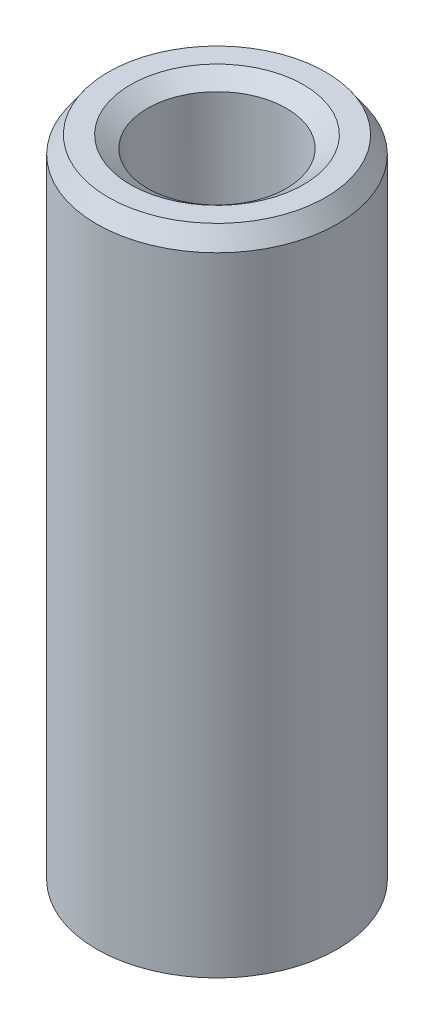
ISO-10303-21;
HEADER;
FILE_DESCRIPTION(('STEP AP214'),'2;1');
FILE_NAME('part.step','',(''),(''),'','','');
FILE_SCHEMA(('AUTOMOTIVE_DESIGN { 1 0 10303 214 1 1 1 1 }'));
ENDSEC;
DATA;
#1=APPLICATION_CONTEXT('core data for automotive mechanical design processes');
#2=APPLICATION_PROTOCOL_DEFINITION('international standard','automotive_design',2000,#1);
#3=PRODUCT_CONTEXT('',#1,'mechanical');
#4=PRODUCT('Part','Part','',(#3));
#5=PRODUCT_RELATED_PRODUCT_CATEGORY('part','',(#4));
#6=PRODUCT_DEFINITION_FORMATION('','',#4);
#7=PRODUCT_DEFINITION_CONTEXT('part definition',#1,'design');
#8=PRODUCT_DEFINITION('design','',#6,#7);
#9=PRODUCT_DEFINITION_SHAPE('','',#8);
#10=(LENGTH_UNIT() NAMED_UNIT(*) SI_UNIT(.MILLI.,.METRE.));
#11=(NAMED_UNIT(*) PLANE_ANGLE_UNIT() SI_UNIT($,.RADIAN.));
#12=(NAMED_UNIT(*) SI_UNIT($,.STERADIAN.) SOLID_ANGLE_UNIT());
#13=UNCERTAINTY_MEASURE_WITH_UNIT(LENGTH_MEASURE(1.E-05),#10,'distance_accuracy_value','');
#14=(GEOMETRIC_REPRESENTATION_CONTEXT(3) GLOBAL_UNCERTAINTY_ASSIGNED_CONTEXT((#13)) GLOBAL_UNIT_ASSIGNED_CONTEXT((#10,
#11,#12)) REPRESENTATION_CONTEXT('',''));
#15=CARTESIAN_POINT('',(0.,0.,0.));
#16=DIRECTION('',(0.,0.,1.));
#17=DIRECTION('',(1.,0.,0.));
#18=AXIS2_PLACEMENT_3D('',#15,#16,#17);
#19=CARTESIAN_POINT('',(0.,122.712555154671,0.));
#20=DIRECTION('',(0.,-1.,0.));
#21=DIRECTION('',(0.,0.,-1.));
#22=AXIS2_PLACEMENT_3D('',#19,#20,#21);
#23=CYLINDRICAL_SURFACE('',#22,22.5);
#24=CARTESIAN_POINT('',(0.,2.20859151503121,0.));
#25=DIRECTION('',(0.,1.,0.));
#26=DIRECTION('',(0.,0.,1.));
#27=AXIS2_PLACEMENT_3D('',#24,#25,#26);
#28=CIRCLE('',#27,22.5);
#29=CARTESIAN_POINT('',(0.,2.20859151503121,22.5));
#30=VERTEX_POINT('',#29);
#31=EDGE_CURVE('E10',#30,#30,#28,.T.);
#32=ORIENTED_EDGE('',*,*,#31,.T.);
#33=EDGE_LOOP('',(#32));
#34=FACE_BOUND('',#33,.T.);
#35=CARTESIAN_POINT('',(0.,119.515010099549,0.));
#36=DIRECTION('',(0.,1.,0.));
#37=DIRECTION('',(0.,0.,1.));
#38=AXIS2_PLACEMENT_3D('',#35,#36,#37);
#39=CIRCLE('',#38,22.5);
#40=CARTESIAN_POINT('',(0.,119.515010099549,22.5));
#41=VERTEX_POINT('',#40);
#42=EDGE_CURVE('E50',#41,#41,#39,.F.);
#43=ORIENTED_EDGE('',*,*,#42,.T.);
#44=EDGE_LOOP('',(#43));
#45=FACE_BOUND('',#44,.T.);
#46=ADVANCED_FACE('F39',(#34,#45),#23,.T.);
#47=CARTESIAN_POINT('',(0.,122.712555154671,0.));
#48=DIRECTION('',(0.,1.,0.));
#49=DIRECTION('',(0.,0.,1.));
#50=AXIS2_PLACEMENT_3D('',#47,#48,#49);
#51=PLANE('',#50);
#52=CARTESIAN_POINT('',(0.,122.712555154671,0.));
#53=DIRECTION('',(0.,1.,0.));
#54=DIRECTION('',(0.,0.,1.));
#55=AXIS2_PLACEMENT_3D('',#52,#53,#54);
#56=CIRCLE('',#55,16.1676856209604);
#57=CARTESIAN_POINT('',(0.,122.712555154671,16.1676856209604));
#58=VERTEX_POINT('',#57);
#59=EDGE_CURVE('E58',#58,#58,#56,.F.);
#60=ORIENTED_EDGE('',*,*,#59,.T.);
#61=EDGE_LOOP('',(#60));
#62=FACE_BOUND('',#61,.T.);
#63=CARTESIAN_POINT('',(0.,122.712555154671,0.));
#64=DIRECTION('',(0.,1.,0.));
#65=DIRECTION('',(0.,0.,1.));
#66=AXIS2_PLACEMENT_3D('',#63,#64,#65);
#67=CIRCLE('',#66,20.2914084849688);
#68=CARTESIAN_POINT('',(0.,122.712555154671,20.2914084849688));
#69=VERTEX_POINT('',#68);
#70=EDGE_CURVE('E61',#69,#69,#67,.T.);
#71=ORIENTED_EDGE('',*,*,#70,.T.);
#72=EDGE_LOOP('',(#71));
#73=FACE_BOUND('',#72,.T.);
#74=ADVANCED_FACE('F88',(#62,#73),#51,.T.);
#75=CARTESIAN_POINT('',(0.,0.,0.));
#76=DIRECTION('',(0.,1.,0.));
#77=DIRECTION('',(0.,0.,1.));
#78=AXIS2_PLACEMENT_3D('',#75,#76,#77);
#79=PLANE('',#78);
#80=CARTESIAN_POINT('',(0.,0.,0.));
#81=DIRECTION('',(0.,1.,0.));
#82=DIRECTION('',(0.,0.,1.));
#83=AXIS2_PLACEMENT_3D('',#80,#81,#82);
#84=CIRCLE('',#83,15.17873208087);
#85=CARTESIAN_POINT('',(0.,0.,-15.17873208087));
#86=VERTEX_POINT('',#85);
#87=EDGE_CURVE('E51',#86,#86,#84,.T.);
#88=ORIENTED_EDGE('',*,*,#87,.T.);
#89=EDGE_LOOP('',(#88));
#90=FACE_BOUND('',#89,.T.);
#91=CARTESIAN_POINT('',(0.,0.,0.));
#92=DIRECTION('',(0.,1.,0.));
#93=DIRECTION('',(0.,0.,1.));
#94=AXIS2_PLACEMENT_3D('',#91,#92,#93);
#95=CIRCLE('',#94,19.3024549448785);
#96=CARTESIAN_POINT('',(0.,0.,19.3024549448785));
#97=VERTEX_POINT('',#96);
#98=EDGE_CURVE('E54',#97,#97,#95,.F.);
#99=ORIENTED_EDGE('',*,*,#98,.T.);
#100=EDGE_LOOP('',(#99));
#101=FACE_BOUND('',#100,.T.);
#102=ADVANCED_FACE('F83',(#90,#101),#79,.F.);
#103=CARTESIAN_POINT('',(0.,122.712555154671,0.));
#104=DIRECTION('',(0.,-1.,0.));
#105=DIRECTION('',(0.,0.,-1.));
#106=AXIS2_PLACEMENT_3D('',#103,#104,#105);
#107=CYLINDRICAL_SURFACE('',#106,12.9701405658388);
#108=CARTESIAN_POINT('',(0.,120.50396363964,0.));
#109=DIRECTION('',(0.,1.,0.));
#110=DIRECTION('',(0.,0.,1.));
#111=AXIS2_PLACEMENT_3D('',#108,#109,#110);
#112=CIRCLE('',#111,12.9701405658388);
#113=CARTESIAN_POINT('',(0.,120.50396363964,12.9701405658388));
#114=VERTEX_POINT('',#113);
#115=EDGE_CURVE('E67',#114,#114,#112,.T.);
#116=ORIENTED_EDGE('',*,*,#115,.T.);
#117=EDGE_LOOP('',(#116));
#118=FACE_BOUND('',#117,.T.);
#119=CARTESIAN_POINT('',(0.,3.19754505512151,0.));
#120=DIRECTION('',(0.,1.,0.));
#121=DIRECTION('',(0.,0.,1.));
#122=AXIS2_PLACEMENT_3D('',#119,#120,#121);
#123=CIRCLE('',#122,12.9701405658388);
#124=CARTESIAN_POINT('',(0.,3.19754505512151,-12.9701405658388));
#125=VERTEX_POINT('',#124);
#126=EDGE_CURVE('E69',#125,#125,#123,.F.);
#127=ORIENTED_EDGE('',*,*,#126,.T.);
#128=EDGE_LOOP('',(#127));
#129=FACE_BOUND('',#128,.T.);
#130=ADVANCED_FACE('F71',(#118,#129),#107,.F.);
#131=CARTESIAN_POINT('',(0.,120.50396363964,0.));
#132=DIRECTION('',(0.,1.,0.));
#133=DIRECTION('',(0.,0.,1.));
#134=AXIS2_PLACEMENT_3D('',#131,#132,#133);
#135=CONICAL_SURFACE('',#134,12.9701405658388,0.966329299025611);
#136=ORIENTED_EDGE('',*,*,#59,.F.);
#137=EDGE_LOOP('',(#136));
#138=FACE_BOUND('',#137,.T.);
#139=ORIENTED_EDGE('',*,*,#115,.F.);
#140=EDGE_LOOP('',(#139));
#141=FACE_BOUND('',#140,.T.);
#142=ADVANCED_FACE('F77',(#138,#141),#135,.F.);
#143=CARTESIAN_POINT('',(0.,0.,0.));
#144=DIRECTION('',(0.,-1.,0.));
#145=DIRECTION('',(0.,0.,-1.));
#146=AXIS2_PLACEMENT_3D('',#143,#144,#145);
#147=CONICAL_SURFACE('',#146,15.17873208087,0.604467027769286);
#148=CARTESIAN_POINT('',(0.,3.19754505512151,-12.9701405658388));
#149=CARTESIAN_POINT('',(0.,3.16423729413066,-12.9931467274537));
#150=CARTESIAN_POINT('',(0.,3.13092953313982,-13.0161528890687));
#151=CARTESIAN_POINT('',(0.,3.06431401115812,-13.0621652122985));
#152=CARTESIAN_POINT('',(0.,3.03100625016727,-13.0851713739134));
#153=CARTESIAN_POINT('',(0.,2.96439072818557,-13.1311836971432));
#154=CARTESIAN_POINT('',(0.,2.93108296719472,-13.1541898587581));
#155=CARTESIAN_POINT('',(0.,2.86446744521302,-13.2002021819879));
#156=CARTESIAN_POINT('',(0.,2.83115968422217,-13.2232083436028));
#157=CARTESIAN_POINT('',(0.,2.76454416224048,-13.2692206668327));
#158=CARTESIAN_POINT('',(0.,2.73123640124963,-13.2922268284476));
#159=CARTESIAN_POINT('',(0.,2.66462087926793,-13.3382391516774));
#160=CARTESIAN_POINT('',(0.,2.63131311827708,-13.3612453132923));
#161=CARTESIAN_POINT('',(0.,2.56469759629538,-13.4072576365221));
#162=CARTESIAN_POINT('',(0.,2.53138983530453,-13.430263798137));
#163=CARTESIAN_POINT('',(0.,2.46477431332283,-13.4762761213668));
#164=CARTESIAN_POINT('',(0.,2.43146655233198,-13.4992822829817));
#165=CARTESIAN_POINT('',(0.,2.36485103035029,-13.5452946062116));
#166=CARTESIAN_POINT('',(0.,2.33154326935944,-13.5683007678265));
#167=CARTESIAN_POINT('',(0.,2.26492774737774,-13.6143130910563));
#168=CARTESIAN_POINT('',(0.,2.23161998638689,-13.6373192526712));
#169=CARTESIAN_POINT('',(0.,2.16500446440519,-13.683331575901));
#170=CARTESIAN_POINT('',(0.,2.13169670341434,-13.7063377375159));
#171=CARTESIAN_POINT('',(0.,2.06508118143264,-13.7523500607457));
#172=CARTESIAN_POINT('',(0.,2.0317734204418,-13.7753562223606));
#173=CARTESIAN_POINT('',(0.,1.9651578984601,-13.8213685455905));
#174=CARTESIAN_POINT('',(0.,1.93185013746925,-13.8443747072054));
#175=CARTESIAN_POINT('',(0.,1.86523461548755,-13.8903870304352));
#176=CARTESIAN_POINT('',(0.,1.8319268544967,-13.9133931920501));
#177=CARTESIAN_POINT('',(0.,1.765311332515,-13.9594055152799));
#178=CARTESIAN_POINT('',(0.,1.73200357152415,-13.9824116768948));
#179=CARTESIAN_POINT('',(0.,1.66538804954246,-14.0284240001246));
#180=CARTESIAN_POINT('',(0.,1.63208028855161,-14.0514301617395));
#181=CARTESIAN_POINT('',(0.,1.56546476656991,-14.0974424849694));
#182=CARTESIAN_POINT('',(0.,1.53215700557906,-14.1204486465843));
#183=CARTESIAN_POINT('',(0.,1.46554148359736,-14.1664609698141));
#184=CARTESIAN_POINT('',(0.,1.43223372260651,-14.189467131429));
#185=CARTESIAN_POINT('',(0.,1.36561820062481,-14.2354794546588));
#186=CARTESIAN_POINT('',(0.,1.33231043963396,-14.2584856162737));
#187=CARTESIAN_POINT('',(0.,1.26569491765227,-14.3044979395035));
#188=CARTESIAN_POINT('',(0.,1.23238715666142,-14.3275041011184));
#189=CARTESIAN_POINT('',(0.,1.16577163467972,-14.3735164243483));
#190=CARTESIAN_POINT('',(0.,1.13246387368887,-14.3965225859632));
#191=CARTESIAN_POINT('',(0.,1.06584835170717,-14.442534909193));
#192=CARTESIAN_POINT('',(0.,1.03254059071632,-14.4655410708079));
#193=CARTESIAN_POINT('',(0.,0.965925068734624,-14.5115533940377));
#194=CARTESIAN_POINT('',(0.,0.932617307743775,-14.5345595556526));
#195=CARTESIAN_POINT('',(0.,0.866001785762077,-14.5805718788824));
#196=CARTESIAN_POINT('',(0.,0.832694024771228,-14.6035780404973));
#197=CARTESIAN_POINT('',(0.,0.766078502789529,-14.6495903637272));
#198=CARTESIAN_POINT('',(0.,0.73277074179868,-14.6725965253421));
#199=CARTESIAN_POINT('',(0.,0.666155219816982,-14.7186088485719));
#200=CARTESIAN_POINT('',(0.,0.632847458826133,-14.7416150101868));
#201=CARTESIAN_POINT('',(0.,0.566231936844435,-14.7876273334166));
#202=CARTESIAN_POINT('',(0.,0.532924175853586,-14.8106334950315));
#203=CARTESIAN_POINT('',(0.,0.466308653871888,-14.8566458182613));
#204=CARTESIAN_POINT('',(0.,0.433000892881038,-14.8796519798762));
#205=CARTESIAN_POINT('',(0.,0.36638537089934,-14.9256643031061));
#206=CARTESIAN_POINT('',(0.,0.333077609908491,-14.948670464721));
#207=CARTESIAN_POINT('',(0.,0.266462087926793,-14.9946827879508));
#208=CARTESIAN_POINT('',(0.,0.233154326935944,-15.0176889495657));
#209=CARTESIAN_POINT('',(0.,0.166538804954246,-15.0637012727955));
#210=CARTESIAN_POINT('',(0.,0.133231043963396,-15.0867074344104));
#211=CARTESIAN_POINT('',(0.,0.0666155219816979,-15.1327197576402));
#212=CARTESIAN_POINT('',(0.,0.0333077609908487,-15.1557259192551));
#213=CARTESIAN_POINT('',(0.,0.,-15.17873208087));
#214=B_SPLINE_CURVE_WITH_KNOTS('',3,(#148,#149,#150,#151,#152,#153,#154,#155,#156,#157,#158,
#159,#160,#161,#162,#163,#164,#165,#166,#167,#168,#169,#170,#171,#172,#173,#174,#175,#176,#177,
#178,#179,#180,#181,#182,#183,#184,#185,#186,#187,#188,#189,#190,#191,#192,#193,#194,#195,#196,
#197,#198,#199,#200,#201,#202,#203,#204,#205,#206,#207,#208,#209,#210,#211,#212,#213),
.UNSPECIFIED.,.F.,.F.,(4,2,2,2,2,2,2,2,2,2,2,2,2,2,2,2,2,2,2,2,2,2,2,2,2,2,2,2,2,2,2,2,4),(0.,
0.121442223836166,0.242884447672332,0.364326671508496,0.485768895344662,0.607211119180828,
0.728653343016993,0.850095566853159,0.971537790689324,1.09298001452549,1.21442223836165,
1.33586446219782,1.45730668603399,1.57874890987015,1.70019113370632,1.82163335754248,
1.94307558137865,2.06451780521481,2.18596002905098,2.30740225288714,2.42884447672331,
2.55028670055947,2.67172892439564,2.79317114823181,2.91461337206797,3.03605559590414,
3.1574978197403,3.27894004357647,3.40038226741263,3.5218244912488,3.64326671508497,
3.76470893892113,3.8861511627573),.UNSPECIFIED.);
#215=EDGE_CURVE('BSEAM73',#125,#86,#214,.T.);
#216=ORIENTED_EDGE('',*,*,#126,.F.);
#217=ORIENTED_EDGE('',*,*,#87,.F.);
#218=ORIENTED_EDGE('',*,*,#215,.T.);
#219=ORIENTED_EDGE('',*,*,#215,.F.);
#220=EDGE_LOOP('',(#216,#218,#217,#219));
#221=FACE_BOUND('',#220,.T.);
#222=ADVANCED_FACE('F73',(#221),#147,.F.);
#223=CARTESIAN_POINT('',(0.,2.20859151503121,0.));
#224=DIRECTION('',(0.,1.,0.));
#225=DIRECTION('',(0.,0.,1.));
#226=AXIS2_PLACEMENT_3D('',#223,#224,#225);
#227=CONICAL_SURFACE('',#226,22.5,0.966329299025614);
#228=ORIENTED_EDGE('',*,*,#98,.F.);
#229=EDGE_LOOP('',(#228));
#230=FACE_BOUND('',#229,.T.);
#231=ORIENTED_EDGE('',*,*,#31,.F.);
#232=EDGE_LOOP('',(#231));
#233=FACE_BOUND('',#232,.T.);
#234=ADVANCED_FACE('F76',(#230,#233),#227,.T.);
#235=CARTESIAN_POINT('',(0.,122.712555154671,0.));
#236=DIRECTION('',(0.,-1.,0.));
#237=DIRECTION('',(0.,0.,-1.));
#238=AXIS2_PLACEMENT_3D('',#235,#236,#237);
#239=CONICAL_SURFACE('',#238,20.2914084849688,0.604467027769283);
#240=ORIENTED_EDGE('',*,*,#42,.F.);
#241=EDGE_LOOP('',(#240));
#242=FACE_BOUND('',#241,.T.);
#243=ORIENTED_EDGE('',*,*,#70,.F.);
#244=EDGE_LOOP('',(#243));
#245=FACE_BOUND('',#244,.T.);
#246=ADVANCED_FACE('F45',(#242,#245),#239,.T.);
#247=CLOSED_SHELL('',(#46,#74,#102,#130,#142,#222,#234,#246));
#248=MANIFOLD_SOLID_BREP('B2',#247);
#249=ADVANCED_BREP_SHAPE_REPRESENTATION('',(#18,#248),#14);
#250=SHAPE_DEFINITION_REPRESENTATION(#9,#249);
ENDSEC;
END-ISO-10303-21;
